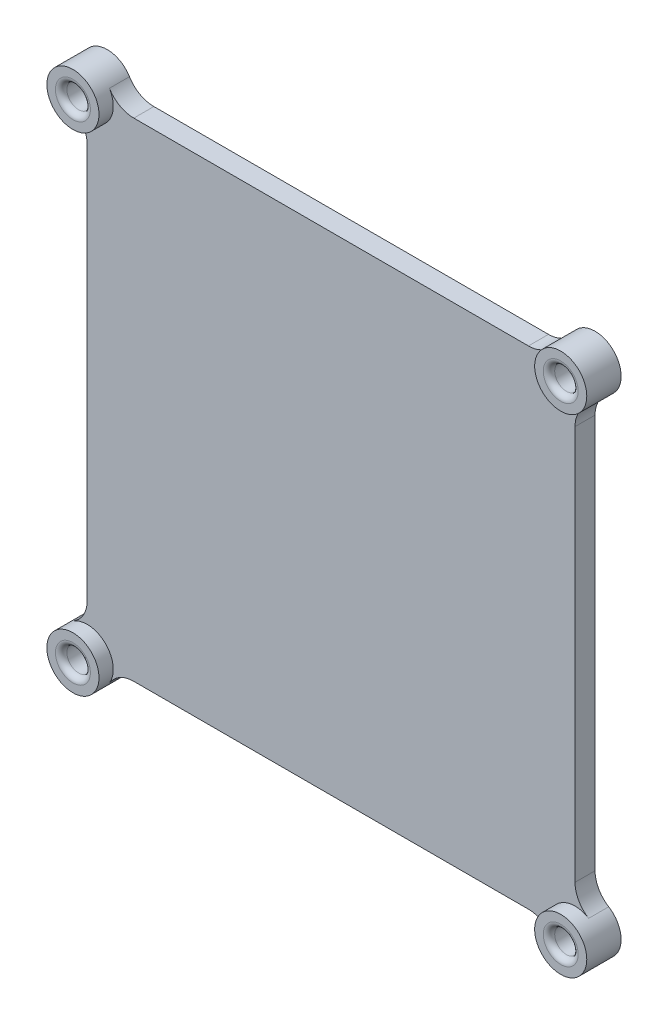
ISO-10303-21;
HEADER;
FILE_DESCRIPTION(('STEP AP214'),'2;1');
FILE_NAME('part.step','',(''),(''),'','','');
FILE_SCHEMA(('AUTOMOTIVE_DESIGN { 1 0 10303 214 1 1 1 1 }'));
ENDSEC;
DATA;
#1=APPLICATION_CONTEXT('core data for automotive mechanical design processes');
#2=APPLICATION_PROTOCOL_DEFINITION('international standard','automotive_design',2000,#1);
#3=PRODUCT_CONTEXT('',#1,'mechanical');
#4=PRODUCT('Part','Part','',(#3));
#5=PRODUCT_RELATED_PRODUCT_CATEGORY('part','',(#4));
#6=PRODUCT_DEFINITION_FORMATION('','',#4);
#7=PRODUCT_DEFINITION_CONTEXT('part definition',#1,'design');
#8=PRODUCT_DEFINITION('design','',#6,#7);
#9=PRODUCT_DEFINITION_SHAPE('','',#8);
#10=(LENGTH_UNIT() NAMED_UNIT(*) SI_UNIT(.MILLI.,.METRE.));
#11=(NAMED_UNIT(*) PLANE_ANGLE_UNIT() SI_UNIT($,.RADIAN.));
#12=(NAMED_UNIT(*) SI_UNIT($,.STERADIAN.) SOLID_ANGLE_UNIT());
#13=UNCERTAINTY_MEASURE_WITH_UNIT(LENGTH_MEASURE(1.E-05),#10,'distance_accuracy_value','');
#14=(GEOMETRIC_REPRESENTATION_CONTEXT(3) GLOBAL_UNCERTAINTY_ASSIGNED_CONTEXT((#13)) GLOBAL_UNIT_ASSIGNED_CONTEXT((#10,
#11,#12)) REPRESENTATION_CONTEXT('',''));
#15=CARTESIAN_POINT('',(0.,0.,0.));
#16=DIRECTION('',(0.,0.,1.));
#17=DIRECTION('',(1.,0.,0.));
#18=AXIS2_PLACEMENT_3D('',#15,#16,#17);
#19=CARTESIAN_POINT('',(0.,0.,3.5));
#20=DIRECTION('',(0.,0.,1.));
#21=DIRECTION('',(1.,0.,0.));
#22=AXIS2_PLACEMENT_3D('',#19,#20,#21);
#23=PLANE('',#22);
#24=CARTESIAN_POINT('',(-7.5,-74.5635081269628,3.5));
#25=DIRECTION('',(0.,0.,1.));
#26=DIRECTION('',(1.,0.,0.));
#27=AXIS2_PLACEMENT_3D('',#24,#25,#26);
#28=CIRCLE('',#27,5.);
#29=CARTESIAN_POINT('',(-2.5,-74.5635081269628,3.5));
#30=VERTEX_POINT('',#29);
#31=CARTESIAN_POINT('',(-4.88219895287958,-78.8234515159875,3.5));
#32=VERTEX_POINT('',#31);
#33=EDGE_CURVE('E181',#30,#32,#28,.F.);
#34=ORIENTED_EDGE('',*,*,#33,.T.);
#35=CARTESIAN_POINT('',(-2.49999999999941,-82.7,3.5));
#36=DIRECTION('',(0.,0.,1.));
#37=DIRECTION('',(1.,0.,0.));
#38=AXIS2_PLACEMENT_3D('',#35,#36,#37);
#39=CIRCLE('',#38,4.55);
#40=CARTESIAN_POINT('',(1.37654848401279,-85.0821989528796,3.5));
#41=VERTEX_POINT('',#40);
#42=EDGE_CURVE('E173',#41,#32,#39,.T.);
#43=ORIENTED_EDGE('',*,*,#42,.F.);
#44=CARTESIAN_POINT('',(5.63649187303717,-87.7,3.5));
#45=DIRECTION('',(0.,0.,1.));
#46=DIRECTION('',(1.,0.,0.));
#47=AXIS2_PLACEMENT_3D('',#44,#45,#46);
#48=CIRCLE('',#47,5.);
#49=CARTESIAN_POINT('',(5.63649187303717,-82.7,3.5));
#50=VERTEX_POINT('',#49);
#51=EDGE_CURVE('E156',#41,#50,#48,.F.);
#52=ORIENTED_EDGE('',*,*,#51,.T.);
#53=DIRECTION('',(1.,0.,0.));
#54=VECTOR('',#53,1.);
#55=CARTESIAN_POINT('',(0.,-82.7,3.5));
#56=LINE('',#55,#54);
#57=CARTESIAN_POINT('',(74.5635081269628,-82.7,3.5));
#58=VERTEX_POINT('',#57);
#59=EDGE_CURVE('E221',#50,#58,#56,.T.);
#60=ORIENTED_EDGE('',*,*,#59,.T.);
#61=CARTESIAN_POINT('',(74.5635081269628,-87.7,3.5));
#62=DIRECTION('',(0.,0.,1.));
#63=DIRECTION('',(1.,0.,0.));
#64=AXIS2_PLACEMENT_3D('',#61,#62,#63);
#65=CIRCLE('',#64,5.);
#66=CARTESIAN_POINT('',(78.8234515159875,-85.0821989528796,3.5));
#67=VERTEX_POINT('',#66);
#68=EDGE_CURVE('E286',#58,#67,#65,.F.);
#69=ORIENTED_EDGE('',*,*,#68,.T.);
#70=CARTESIAN_POINT('',(82.7000000000006,-82.7,3.5));
#71=DIRECTION('',(0.,0.,1.));
#72=DIRECTION('',(1.,0.,0.));
#73=AXIS2_PLACEMENT_3D('',#70,#71,#72);
#74=CIRCLE('',#73,4.55);
#75=CARTESIAN_POINT('',(85.0821989528799,-78.8234515159875,3.5));
#76=VERTEX_POINT('',#75);
#77=EDGE_CURVE('E187',#76,#67,#74,.T.);
#78=ORIENTED_EDGE('',*,*,#77,.F.);
#79=CARTESIAN_POINT('',(87.7,-74.5635081269628,3.5));
#80=DIRECTION('',(0.,0.,1.));
#81=DIRECTION('',(1.,0.,0.));
#82=AXIS2_PLACEMENT_3D('',#79,#80,#81);
#83=CIRCLE('',#82,5.);
#84=CARTESIAN_POINT('',(82.7,-74.5635081269628,3.5));
#85=VERTEX_POINT('',#84);
#86=EDGE_CURVE('E290',#76,#85,#83,.F.);
#87=ORIENTED_EDGE('',*,*,#86,.T.);
#88=DIRECTION('',(0.,-1.,0.));
#89=VECTOR('',#88,1.);
#90=CARTESIAN_POINT('',(82.7,0.,3.5));
#91=LINE('',#90,#89);
#92=CARTESIAN_POINT('',(82.7,-5.63649187303699,3.5));
#93=VERTEX_POINT('',#92);
#94=EDGE_CURVE('E224',#93,#85,#91,.T.);
#95=ORIENTED_EDGE('',*,*,#94,.F.);
#96=CARTESIAN_POINT('',(87.7,-5.63649187303699,3.5));
#97=DIRECTION('',(0.,0.,1.));
#98=DIRECTION('',(1.,0.,0.));
#99=AXIS2_PLACEMENT_3D('',#96,#97,#98);
#100=CIRCLE('',#99,5.);
#101=CARTESIAN_POINT('',(85.0821989528794,-1.37654848401239,3.5));
#102=VERTEX_POINT('',#101);
#103=EDGE_CURVE('E294',#93,#102,#100,.F.);
#104=ORIENTED_EDGE('',*,*,#103,.T.);
#105=CARTESIAN_POINT('',(82.6999999999997,2.5,3.5));
#106=DIRECTION('',(0.,0.,1.));
#107=DIRECTION('',(1.,0.,0.));
#108=AXIS2_PLACEMENT_3D('',#105,#106,#107);
#109=CIRCLE('',#108,4.55);
#110=CARTESIAN_POINT('',(78.8234515159872,4.88219895287958,3.5));
#111=VERTEX_POINT('',#110);
#112=EDGE_CURVE('E195',#111,#102,#109,.T.);
#113=ORIENTED_EDGE('',*,*,#112,.F.);
#114=CARTESIAN_POINT('',(74.5635081269625,7.5,3.5));
#115=DIRECTION('',(0.,0.,1.));
#116=DIRECTION('',(1.,0.,0.));
#117=AXIS2_PLACEMENT_3D('',#114,#115,#116);
#118=CIRCLE('',#117,5.);
#119=CARTESIAN_POINT('',(74.5635081269625,2.5,3.5));
#120=VERTEX_POINT('',#119);
#121=EDGE_CURVE('E298',#111,#120,#118,.F.);
#122=ORIENTED_EDGE('',*,*,#121,.T.);
#123=DIRECTION('',(1.,0.,0.));
#124=VECTOR('',#123,1.);
#125=CARTESIAN_POINT('',(0.,2.5,3.5));
#126=LINE('',#125,#124);
#127=CARTESIAN_POINT('',(5.63649187303688,2.5,3.5));
#128=VERTEX_POINT('',#127);
#129=EDGE_CURVE('E177',#128,#120,#126,.T.);
#130=ORIENTED_EDGE('',*,*,#129,.F.);
#131=CARTESIAN_POINT('',(5.63649187303688,7.5,3.5));
#132=DIRECTION('',(0.,0.,1.));
#133=DIRECTION('',(1.,0.,0.));
#134=AXIS2_PLACEMENT_3D('',#131,#132,#133);
#135=CIRCLE('',#134,5.);
#136=CARTESIAN_POINT('',(1.37654848401218,4.88219895287958,3.5));
#137=VERTEX_POINT('',#136);
#138=EDGE_CURVE('E302',#128,#137,#135,.F.);
#139=ORIENTED_EDGE('',*,*,#138,.T.);
#140=CARTESIAN_POINT('',(-2.50000000000029,2.5,3.5));
#141=DIRECTION('',(0.,0.,1.));
#142=DIRECTION('',(1.,0.,0.));
#143=AXIS2_PLACEMENT_3D('',#140,#141,#142);
#144=CIRCLE('',#143,4.55);
#145=CARTESIAN_POINT('',(-4.88219895287973,-1.37654848401256,3.5));
#146=VERTEX_POINT('',#145);
#147=EDGE_CURVE('E56',#146,#137,#144,.T.);
#148=ORIENTED_EDGE('',*,*,#147,.F.);
#149=CARTESIAN_POINT('',(-7.5,-5.63649187303735,3.5));
#150=DIRECTION('',(0.,0.,1.));
#151=DIRECTION('',(1.,0.,0.));
#152=AXIS2_PLACEMENT_3D('',#149,#150,#151);
#153=CIRCLE('',#152,5.);
#154=CARTESIAN_POINT('',(-2.5,-5.63649187303735,3.5));
#155=VERTEX_POINT('',#154);
#156=EDGE_CURVE('E206',#146,#155,#153,.F.);
#157=ORIENTED_EDGE('',*,*,#156,.T.);
#158=DIRECTION('',(0.,-1.,0.));
#159=VECTOR('',#158,1.);
#160=CARTESIAN_POINT('',(-2.5,0.,3.5));
#161=LINE('',#160,#159);
#162=EDGE_CURVE('E219',#155,#30,#161,.T.);
#163=ORIENTED_EDGE('',*,*,#162,.T.);
#164=EDGE_LOOP('',(#34,#43,#52,#60,#69,#78,#87,#95,#104,#113,#122,#130,#139,#148,#157,#163));
#165=FACE_BOUND('',#164,.T.);
#166=ADVANCED_FACE('F41',(#165),#23,.T.);
#167=CARTESIAN_POINT('',(-2.50000000000029,2.5,3.5));
#168=DIRECTION('',(0.,0.,-1.));
#169=DIRECTION('',(-1.,0.,0.));
#170=AXIS2_PLACEMENT_3D('',#167,#168,#169);
#171=CYLINDRICAL_SURFACE('',#170,4.55);
#172=DIRECTION('',(0.,0.,-1.));
#173=VECTOR('',#172,1.);
#174=CARTESIAN_POINT('',(-4.88219895287973,-1.37654848401256,3.5));
#175=LINE('',#174,#173);
#176=CARTESIAN_POINT('',(-4.88219895287973,-1.37654848401256,0.));
#177=VERTEX_POINT('',#176);
#178=EDGE_CURVE('E277',#177,#146,#175,.F.);
#179=ORIENTED_EDGE('',*,*,#178,.T.);
#180=ORIENTED_EDGE('',*,*,#147,.T.);
#181=DIRECTION('',(0.,0.,-1.));
#182=VECTOR('',#181,1.);
#183=CARTESIAN_POINT('',(1.37654848401218,4.88219895287958,3.5));
#184=LINE('',#183,#182);
#185=CARTESIAN_POINT('',(1.37654848401218,4.88219895287958,0.));
#186=VERTEX_POINT('',#185);
#187=EDGE_CURVE('E279',#137,#186,#184,.T.);
#188=ORIENTED_EDGE('',*,*,#187,.T.);
#189=CARTESIAN_POINT('',(-2.50000000000029,2.5,0.));
#190=DIRECTION('',(0.,0.,1.));
#191=DIRECTION('',(1.,0.,0.));
#192=AXIS2_PLACEMENT_3D('',#189,#190,#191);
#193=CIRCLE('',#192,4.55);
#194=EDGE_CURVE('E218',#186,#177,#193,.T.);
#195=ORIENTED_EDGE('',*,*,#194,.T.);
#196=EDGE_LOOP('',(#179,#180,#188,#195));
#197=FACE_BOUND('',#196,.T.);
#198=CARTESIAN_POINT('',(-2.50000000000029,2.5,6.));
#199=DIRECTION('',(0.,0.,1.));
#200=DIRECTION('',(1.,0.,0.));
#201=AXIS2_PLACEMENT_3D('',#198,#199,#200);
#202=CIRCLE('',#201,4.55);
#203=CARTESIAN_POINT('',(2.04999999999971,2.5,6.));
#204=VERTEX_POINT('',#203);
#205=EDGE_CURVE('E198',#204,#204,#202,.T.);
#206=ORIENTED_EDGE('',*,*,#205,.F.);
#207=EDGE_LOOP('',(#206));
#208=FACE_BOUND('',#207,.T.);
#209=ADVANCED_FACE('F338',(#197,#208),#171,.T.);
#210=CARTESIAN_POINT('',(-2.5,0.,3.5));
#211=DIRECTION('',(1.,0.,0.));
#212=DIRECTION('',(0.,0.,-1.));
#213=AXIS2_PLACEMENT_3D('',#210,#211,#212);
#214=PLANE('',#213);
#215=DIRECTION('',(0.,-1.,0.));
#216=VECTOR('',#215,1.);
#217=CARTESIAN_POINT('',(-2.5,0.,0.));
#218=LINE('',#217,#216);
#219=CARTESIAN_POINT('',(-2.5,-5.63649187303735,0.));
#220=VERTEX_POINT('',#219);
#221=CARTESIAN_POINT('',(-2.5,-74.5635081269628,0.));
#222=VERTEX_POINT('',#221);
#223=EDGE_CURVE('E230',#220,#222,#218,.T.);
#224=ORIENTED_EDGE('',*,*,#223,.T.);
#225=DIRECTION('',(0.,0.,1.));
#226=VECTOR('',#225,1.);
#227=CARTESIAN_POINT('',(-2.5,-74.5635081269628,3.5));
#228=LINE('',#227,#226);
#229=EDGE_CURVE('E252',#222,#30,#228,.T.);
#230=ORIENTED_EDGE('',*,*,#229,.T.);
#231=ORIENTED_EDGE('',*,*,#162,.F.);
#232=DIRECTION('',(0.,0.,1.));
#233=VECTOR('',#232,1.);
#234=CARTESIAN_POINT('',(-2.5,-5.63649187303735,0.));
#235=LINE('',#234,#233);
#236=EDGE_CURVE('E249',#155,#220,#235,.F.);
#237=ORIENTED_EDGE('',*,*,#236,.T.);
#238=EDGE_LOOP('',(#224,#230,#231,#237));
#239=FACE_BOUND('',#238,.T.);
#240=ADVANCED_FACE('F343',(#239),#214,.F.);
#241=CARTESIAN_POINT('',(-2.5,-82.7,3.5));
#242=DIRECTION('',(0.,0.,-1.));
#243=DIRECTION('',(-1.,0.,0.));
#244=AXIS2_PLACEMENT_3D('',#241,#242,#243);
#245=CYLINDRICAL_SURFACE('',#244,4.55);
#246=DIRECTION('',(0.,0.,-1.));
#247=VECTOR('',#246,1.);
#248=CARTESIAN_POINT('',(1.37654848401247,-85.0821989528796,3.5));
#249=LINE('',#248,#247);
#250=CARTESIAN_POINT('',(1.37654848401248,-85.0821989528796,0.));
#251=VERTEX_POINT('',#250);
#252=EDGE_CURVE('E159',#251,#41,#249,.F.);
#253=ORIENTED_EDGE('',*,*,#252,.T.);
#254=ORIENTED_EDGE('',*,*,#42,.T.);
#255=DIRECTION('',(0.,0.,-1.));
#256=VECTOR('',#255,1.);
#257=CARTESIAN_POINT('',(-4.88219895287958,-78.8234515159875,3.5));
#258=LINE('',#257,#256);
#259=CARTESIAN_POINT('',(-4.88219895287958,-78.8234515159875,0.));
#260=VERTEX_POINT('',#259);
#261=EDGE_CURVE('E176',#32,#260,#258,.T.);
#262=ORIENTED_EDGE('',*,*,#261,.T.);
#263=CARTESIAN_POINT('',(-2.5,-82.7,0.));
#264=DIRECTION('',(0.,0.,1.));
#265=DIRECTION('',(1.,0.,0.));
#266=AXIS2_PLACEMENT_3D('',#263,#264,#265);
#267=CIRCLE('',#266,4.55);
#268=EDGE_CURVE('E175',#260,#251,#267,.T.);
#269=ORIENTED_EDGE('',*,*,#268,.T.);
#270=EDGE_LOOP('',(#253,#254,#262,#269));
#271=FACE_BOUND('',#270,.T.);
#272=CARTESIAN_POINT('',(-2.49999999999941,-82.7,6.));
#273=DIRECTION('',(0.,0.,1.));
#274=DIRECTION('',(1.,0.,0.));
#275=AXIS2_PLACEMENT_3D('',#272,#273,#274);
#276=CIRCLE('',#275,4.55);
#277=CARTESIAN_POINT('',(2.05000000000059,-82.7,6.));
#278=VERTEX_POINT('',#277);
#279=EDGE_CURVE('E184',#278,#278,#276,.T.);
#280=ORIENTED_EDGE('',*,*,#279,.F.);
#281=EDGE_LOOP('',(#280));
#282=FACE_BOUND('',#281,.T.);
#283=ADVANCED_FACE('F171',(#271,#282),#245,.T.);
#284=CARTESIAN_POINT('',(0.,-82.7,3.5));
#285=DIRECTION('',(0.,1.,0.));
#286=DIRECTION('',(0.,0.,1.));
#287=AXIS2_PLACEMENT_3D('',#284,#285,#286);
#288=PLANE('',#287);
#289=ORIENTED_EDGE('',*,*,#59,.F.);
#290=DIRECTION('',(0.,0.,1.));
#291=VECTOR('',#290,1.);
#292=CARTESIAN_POINT('',(5.63649187303717,-82.7,0.));
#293=LINE('',#292,#291);
#294=CARTESIAN_POINT('',(5.63649187303717,-82.7,0.));
#295=VERTEX_POINT('',#294);
#296=EDGE_CURVE('E161',#50,#295,#293,.F.);
#297=ORIENTED_EDGE('',*,*,#296,.T.);
#298=DIRECTION('',(1.,0.,0.));
#299=VECTOR('',#298,1.);
#300=CARTESIAN_POINT('',(0.,-82.7,0.));
#301=LINE('',#300,#299);
#302=CARTESIAN_POINT('',(74.5635081269628,-82.7,0.));
#303=VERTEX_POINT('',#302);
#304=EDGE_CURVE('E234',#295,#303,#301,.T.);
#305=ORIENTED_EDGE('',*,*,#304,.T.);
#306=DIRECTION('',(0.,0.,1.));
#307=VECTOR('',#306,1.);
#308=CARTESIAN_POINT('',(74.5635081269628,-82.7,3.5));
#309=LINE('',#308,#307);
#310=EDGE_CURVE('E254',#303,#58,#309,.T.);
#311=ORIENTED_EDGE('',*,*,#310,.T.);
#312=EDGE_LOOP('',(#289,#297,#305,#311));
#313=FACE_BOUND('',#312,.T.);
#314=ADVANCED_FACE('F385',(#313),#288,.F.);
#315=CARTESIAN_POINT('',(82.7,-82.7,3.5));
#316=DIRECTION('',(0.,0.,-1.));
#317=DIRECTION('',(-1.,0.,0.));
#318=AXIS2_PLACEMENT_3D('',#315,#316,#317);
#319=CYLINDRICAL_SURFACE('',#318,4.55);
#320=DIRECTION('',(0.,0.,-1.));
#321=VECTOR('',#320,1.);
#322=CARTESIAN_POINT('',(85.0821989528796,-78.8234515159875,3.5));
#323=LINE('',#322,#321);
#324=CARTESIAN_POINT('',(85.0821989528796,-78.8234515159875,0.));
#325=VERTEX_POINT('',#324);
#326=EDGE_CURVE('E257',#325,#76,#323,.F.);
#327=ORIENTED_EDGE('',*,*,#326,.T.);
#328=ORIENTED_EDGE('',*,*,#77,.T.);
#329=DIRECTION('',(0.,0.,-1.));
#330=VECTOR('',#329,1.);
#331=CARTESIAN_POINT('',(78.8234515159875,-85.0821989528796,3.5));
#332=LINE('',#331,#330);
#333=CARTESIAN_POINT('',(78.8234515159875,-85.0821989528796,0.));
#334=VERTEX_POINT('',#333);
#335=EDGE_CURVE('E260',#67,#334,#332,.T.);
#336=ORIENTED_EDGE('',*,*,#335,.T.);
#337=CARTESIAN_POINT('',(82.7,-82.7,0.));
#338=DIRECTION('',(0.,0.,1.));
#339=DIRECTION('',(1.,0.,0.));
#340=AXIS2_PLACEMENT_3D('',#337,#338,#339);
#341=CIRCLE('',#340,4.55);
#342=EDGE_CURVE('E237',#334,#325,#341,.T.);
#343=ORIENTED_EDGE('',*,*,#342,.T.);
#344=EDGE_LOOP('',(#327,#328,#336,#343));
#345=FACE_BOUND('',#344,.T.);
#346=CARTESIAN_POINT('',(82.7000000000006,-82.7,6.));
#347=DIRECTION('',(0.,0.,1.));
#348=DIRECTION('',(1.,0.,0.));
#349=AXIS2_PLACEMENT_3D('',#346,#347,#348);
#350=CIRCLE('',#349,4.55);
#351=CARTESIAN_POINT('',(87.2500000000006,-82.7,6.));
#352=VERTEX_POINT('',#351);
#353=EDGE_CURVE('E183',#352,#352,#350,.T.);
#354=ORIENTED_EDGE('',*,*,#353,.F.);
#355=EDGE_LOOP('',(#354));
#356=FACE_BOUND('',#355,.T.);
#357=ADVANCED_FACE('F381',(#345,#356),#319,.T.);
#358=CARTESIAN_POINT('',(82.7,0.,3.5));
#359=DIRECTION('',(1.,0.,0.));
#360=DIRECTION('',(0.,0.,-1.));
#361=AXIS2_PLACEMENT_3D('',#358,#359,#360);
#362=PLANE('',#361);
#363=ORIENTED_EDGE('',*,*,#94,.T.);
#364=DIRECTION('',(0.,0.,-1.));
#365=VECTOR('',#364,1.);
#366=CARTESIAN_POINT('',(82.7,-74.5635081269628,3.5));
#367=LINE('',#366,#365);
#368=CARTESIAN_POINT('',(82.7,-74.5635081269628,0.));
#369=VERTEX_POINT('',#368);
#370=EDGE_CURVE('E264',#85,#369,#367,.T.);
#371=ORIENTED_EDGE('',*,*,#370,.T.);
#372=DIRECTION('',(0.,-1.,0.));
#373=VECTOR('',#372,1.);
#374=CARTESIAN_POINT('',(82.7,0.,0.));
#375=LINE('',#374,#373);
#376=CARTESIAN_POINT('',(82.7,-5.63649187303699,0.));
#377=VERTEX_POINT('',#376);
#378=EDGE_CURVE('E240',#377,#369,#375,.T.);
#379=ORIENTED_EDGE('',*,*,#378,.F.);
#380=DIRECTION('',(0.,0.,-1.));
#381=VECTOR('',#380,1.);
#382=CARTESIAN_POINT('',(82.7,-5.63649187303699,3.5));
#383=LINE('',#382,#381);
#384=EDGE_CURVE('E262',#377,#93,#383,.F.);
#385=ORIENTED_EDGE('',*,*,#384,.T.);
#386=EDGE_LOOP('',(#363,#371,#379,#385));
#387=FACE_BOUND('',#386,.T.);
#388=ADVANCED_FACE('F377',(#387),#362,.T.);
#389=CARTESIAN_POINT('',(82.6999999999997,2.5,3.5));
#390=DIRECTION('',(0.,0.,-1.));
#391=DIRECTION('',(-1.,0.,0.));
#392=AXIS2_PLACEMENT_3D('',#389,#390,#391);
#393=CYLINDRICAL_SURFACE('',#392,4.55);
#394=DIRECTION('',(0.,0.,-1.));
#395=VECTOR('',#394,1.);
#396=CARTESIAN_POINT('',(78.8234515159872,4.88219895287958,3.5));
#397=LINE('',#396,#395);
#398=CARTESIAN_POINT('',(78.8234515159872,4.88219895287958,0.));
#399=VERTEX_POINT('',#398);
#400=EDGE_CURVE('E267',#399,#111,#397,.F.);
#401=ORIENTED_EDGE('',*,*,#400,.T.);
#402=ORIENTED_EDGE('',*,*,#112,.T.);
#403=DIRECTION('',(0.,0.,-1.));
#404=VECTOR('',#403,1.);
#405=CARTESIAN_POINT('',(85.0821989528794,-1.37654848401239,3.5));
#406=LINE('',#405,#404);
#407=CARTESIAN_POINT('',(85.0821989528794,-1.37654848401239,0.));
#408=VERTEX_POINT('',#407);
#409=EDGE_CURVE('E270',#102,#408,#406,.T.);
#410=ORIENTED_EDGE('',*,*,#409,.T.);
#411=CARTESIAN_POINT('',(82.6999999999997,2.5,0.));
#412=DIRECTION('',(0.,0.,1.));
#413=DIRECTION('',(1.,0.,0.));
#414=AXIS2_PLACEMENT_3D('',#411,#412,#413);
#415=CIRCLE('',#414,4.55);
#416=EDGE_CURVE('E243',#408,#399,#415,.T.);
#417=ORIENTED_EDGE('',*,*,#416,.T.);
#418=EDGE_LOOP('',(#401,#402,#410,#417));
#419=FACE_BOUND('',#418,.T.);
#420=CARTESIAN_POINT('',(82.6999999999997,2.5,6.));
#421=DIRECTION('',(0.,0.,1.));
#422=DIRECTION('',(1.,0.,0.));
#423=AXIS2_PLACEMENT_3D('',#420,#421,#422);
#424=CIRCLE('',#423,4.55);
#425=CARTESIAN_POINT('',(87.2499999999997,2.5,6.));
#426=VERTEX_POINT('',#425);
#427=EDGE_CURVE('E193',#426,#426,#424,.T.);
#428=ORIENTED_EDGE('',*,*,#427,.F.);
#429=EDGE_LOOP('',(#428));
#430=FACE_BOUND('',#429,.T.);
#431=ADVANCED_FACE('F373',(#419,#430),#393,.T.);
#432=CARTESIAN_POINT('',(0.,2.5,3.5));
#433=DIRECTION('',(0.,1.,0.));
#434=DIRECTION('',(0.,0.,1.));
#435=AXIS2_PLACEMENT_3D('',#432,#433,#434);
#436=PLANE('',#435);
#437=ORIENTED_EDGE('',*,*,#129,.T.);
#438=DIRECTION('',(0.,0.,-1.));
#439=VECTOR('',#438,1.);
#440=CARTESIAN_POINT('',(74.5635081269625,2.5,3.5));
#441=LINE('',#440,#439);
#442=CARTESIAN_POINT('',(74.5635081269625,2.5,0.));
#443=VERTEX_POINT('',#442);
#444=EDGE_CURVE('E274',#120,#443,#441,.T.);
#445=ORIENTED_EDGE('',*,*,#444,.T.);
#446=DIRECTION('',(1.,0.,0.));
#447=VECTOR('',#446,1.);
#448=CARTESIAN_POINT('',(0.,2.5,0.));
#449=LINE('',#448,#447);
#450=CARTESIAN_POINT('',(5.63649187303688,2.5,0.));
#451=VERTEX_POINT('',#450);
#452=EDGE_CURVE('E222',#451,#443,#449,.T.);
#453=ORIENTED_EDGE('',*,*,#452,.F.);
#454=DIRECTION('',(0.,0.,-1.));
#455=VECTOR('',#454,1.);
#456=CARTESIAN_POINT('',(5.63649187303688,2.5,3.5));
#457=LINE('',#456,#455);
#458=EDGE_CURVE('E272',#451,#128,#457,.F.);
#459=ORIENTED_EDGE('',*,*,#458,.T.);
#460=EDGE_LOOP('',(#437,#445,#453,#459));
#461=FACE_BOUND('',#460,.T.);
#462=ADVANCED_FACE('F354',(#461),#436,.T.);
#463=CARTESIAN_POINT('',(0.,0.,0.));
#464=DIRECTION('',(0.,0.,1.));
#465=DIRECTION('',(1.,0.,0.));
#466=AXIS2_PLACEMENT_3D('',#463,#464,#465);
#467=PLANE('',#466);
#468=CARTESIAN_POINT('',(87.7,-74.5635081269628,0.));
#469=DIRECTION('',(0.,0.,1.));
#470=DIRECTION('',(1.,0.,0.));
#471=AXIS2_PLACEMENT_3D('',#468,#469,#470);
#472=CIRCLE('',#471,5.);
#473=EDGE_CURVE('E288',#369,#325,#472,.T.);
#474=ORIENTED_EDGE('',*,*,#473,.T.);
#475=ORIENTED_EDGE('',*,*,#342,.F.);
#476=CARTESIAN_POINT('',(74.5635081269628,-87.7,0.));
#477=DIRECTION('',(0.,0.,1.));
#478=DIRECTION('',(1.,0.,0.));
#479=AXIS2_PLACEMENT_3D('',#476,#477,#478);
#480=CIRCLE('',#479,5.);
#481=EDGE_CURVE('E165',#334,#303,#480,.T.);
#482=ORIENTED_EDGE('',*,*,#481,.T.);
#483=ORIENTED_EDGE('',*,*,#304,.F.);
#484=CARTESIAN_POINT('',(5.63649187303717,-87.7,0.));
#485=DIRECTION('',(0.,0.,1.));
#486=DIRECTION('',(1.,0.,0.));
#487=AXIS2_PLACEMENT_3D('',#484,#485,#486);
#488=CIRCLE('',#487,5.);
#489=EDGE_CURVE('E166',#295,#251,#488,.T.);
#490=ORIENTED_EDGE('',*,*,#489,.T.);
#491=ORIENTED_EDGE('',*,*,#268,.F.);
#492=CARTESIAN_POINT('',(-7.5,-74.5635081269628,0.));
#493=DIRECTION('',(0.,0.,1.));
#494=DIRECTION('',(1.,0.,0.));
#495=AXIS2_PLACEMENT_3D('',#492,#493,#494);
#496=CIRCLE('',#495,5.);
#497=EDGE_CURVE('E281',#260,#222,#496,.T.);
#498=ORIENTED_EDGE('',*,*,#497,.T.);
#499=ORIENTED_EDGE('',*,*,#223,.F.);
#500=CARTESIAN_POINT('',(-7.5,-5.63649187303735,0.));
#501=DIRECTION('',(0.,0.,1.));
#502=DIRECTION('',(1.,0.,0.));
#503=AXIS2_PLACEMENT_3D('',#500,#501,#502);
#504=CIRCLE('',#503,5.);
#505=EDGE_CURVE('E64',#220,#177,#504,.T.);
#506=ORIENTED_EDGE('',*,*,#505,.T.);
#507=ORIENTED_EDGE('',*,*,#194,.F.);
#508=CARTESIAN_POINT('',(5.63649187303688,7.5,0.));
#509=DIRECTION('',(0.,0.,1.));
#510=DIRECTION('',(1.,0.,0.));
#511=AXIS2_PLACEMENT_3D('',#508,#509,#510);
#512=CIRCLE('',#511,5.);
#513=EDGE_CURVE('E300',#186,#451,#512,.T.);
#514=ORIENTED_EDGE('',*,*,#513,.T.);
#515=ORIENTED_EDGE('',*,*,#452,.T.);
#516=CARTESIAN_POINT('',(74.5635081269625,7.5,0.));
#517=DIRECTION('',(0.,0.,1.));
#518=DIRECTION('',(1.,0.,0.));
#519=AXIS2_PLACEMENT_3D('',#516,#517,#518);
#520=CIRCLE('',#519,5.);
#521=EDGE_CURVE('E296',#443,#399,#520,.T.);
#522=ORIENTED_EDGE('',*,*,#521,.T.);
#523=ORIENTED_EDGE('',*,*,#416,.F.);
#524=CARTESIAN_POINT('',(87.7,-5.63649187303699,0.));
#525=DIRECTION('',(0.,0.,1.));
#526=DIRECTION('',(1.,0.,0.));
#527=AXIS2_PLACEMENT_3D('',#524,#525,#526);
#528=CIRCLE('',#527,5.);
#529=EDGE_CURVE('E292',#408,#377,#528,.T.);
#530=ORIENTED_EDGE('',*,*,#529,.T.);
#531=ORIENTED_EDGE('',*,*,#378,.T.);
#532=EDGE_LOOP('',(#474,#475,#482,#483,#490,#491,#498,#499,#506,#507,#514,#515,#522,#523,#530,#531));
#533=FACE_BOUND('',#532,.T.);
#534=ADVANCED_FACE('F350',(#533),#467,.F.);
#535=CARTESIAN_POINT('',(-7.5,-74.5635081269628,3.5));
#536=DIRECTION('',(0.,0.,-1.));
#537=DIRECTION('',(-1.,0.,0.));
#538=AXIS2_PLACEMENT_3D('',#535,#536,#537);
#539=CYLINDRICAL_SURFACE('',#538,5.);
#540=ORIENTED_EDGE('',*,*,#33,.F.);
#541=ORIENTED_EDGE('',*,*,#229,.F.);
#542=ORIENTED_EDGE('',*,*,#497,.F.);
#543=ORIENTED_EDGE('',*,*,#261,.F.);
#544=EDGE_LOOP('',(#540,#541,#542,#543));
#545=FACE_BOUND('',#544,.T.);
#546=ADVANCED_FACE('F353',(#545),#539,.F.);
#547=CARTESIAN_POINT('',(5.63649187303717,-87.7,3.5));
#548=DIRECTION('',(0.,0.,-1.));
#549=DIRECTION('',(-1.,0.,0.));
#550=AXIS2_PLACEMENT_3D('',#547,#548,#549);
#551=CYLINDRICAL_SURFACE('',#550,5.);
#552=ORIENTED_EDGE('',*,*,#51,.F.);
#553=ORIENTED_EDGE('',*,*,#252,.F.);
#554=ORIENTED_EDGE('',*,*,#489,.F.);
#555=ORIENTED_EDGE('',*,*,#296,.F.);
#556=EDGE_LOOP('',(#552,#553,#554,#555));
#557=FACE_BOUND('',#556,.T.);
#558=ADVANCED_FACE('F158',(#557),#551,.F.);
#559=CARTESIAN_POINT('',(74.5635081269628,-87.7,3.5));
#560=DIRECTION('',(0.,0.,-1.));
#561=DIRECTION('',(-1.,0.,0.));
#562=AXIS2_PLACEMENT_3D('',#559,#560,#561);
#563=CYLINDRICAL_SURFACE('',#562,5.);
#564=ORIENTED_EDGE('',*,*,#68,.F.);
#565=ORIENTED_EDGE('',*,*,#310,.F.);
#566=ORIENTED_EDGE('',*,*,#481,.F.);
#567=ORIENTED_EDGE('',*,*,#335,.F.);
#568=EDGE_LOOP('',(#564,#565,#566,#567));
#569=FACE_BOUND('',#568,.T.);
#570=ADVANCED_FACE('F405',(#569),#563,.F.);
#571=CARTESIAN_POINT('',(87.7,-74.5635081269628,3.5));
#572=DIRECTION('',(0.,0.,-1.));
#573=DIRECTION('',(-1.,0.,0.));
#574=AXIS2_PLACEMENT_3D('',#571,#572,#573);
#575=CYLINDRICAL_SURFACE('',#574,5.);
#576=ORIENTED_EDGE('',*,*,#86,.F.);
#577=ORIENTED_EDGE('',*,*,#326,.F.);
#578=ORIENTED_EDGE('',*,*,#473,.F.);
#579=ORIENTED_EDGE('',*,*,#370,.F.);
#580=EDGE_LOOP('',(#576,#577,#578,#579));
#581=FACE_BOUND('',#580,.T.);
#582=ADVANCED_FACE('F408',(#581),#575,.F.);
#583=CARTESIAN_POINT('',(87.7,-5.63649187303699,3.5));
#584=DIRECTION('',(0.,0.,-1.));
#585=DIRECTION('',(-1.,0.,0.));
#586=AXIS2_PLACEMENT_3D('',#583,#584,#585);
#587=CYLINDRICAL_SURFACE('',#586,5.);
#588=ORIENTED_EDGE('',*,*,#103,.F.);
#589=ORIENTED_EDGE('',*,*,#384,.F.);
#590=ORIENTED_EDGE('',*,*,#529,.F.);
#591=ORIENTED_EDGE('',*,*,#409,.F.);
#592=EDGE_LOOP('',(#588,#589,#590,#591));
#593=FACE_BOUND('',#592,.T.);
#594=ADVANCED_FACE('F412',(#593),#587,.F.);
#595=CARTESIAN_POINT('',(74.5635081269625,7.5,3.5));
#596=DIRECTION('',(0.,0.,-1.));
#597=DIRECTION('',(-1.,0.,0.));
#598=AXIS2_PLACEMENT_3D('',#595,#596,#597);
#599=CYLINDRICAL_SURFACE('',#598,5.);
#600=ORIENTED_EDGE('',*,*,#121,.F.);
#601=ORIENTED_EDGE('',*,*,#400,.F.);
#602=ORIENTED_EDGE('',*,*,#521,.F.);
#603=ORIENTED_EDGE('',*,*,#444,.F.);
#604=EDGE_LOOP('',(#600,#601,#602,#603));
#605=FACE_BOUND('',#604,.T.);
#606=ADVANCED_FACE('F416',(#605),#599,.F.);
#607=CARTESIAN_POINT('',(5.63649187303688,7.5,3.5));
#608=DIRECTION('',(0.,0.,-1.));
#609=DIRECTION('',(-1.,0.,0.));
#610=AXIS2_PLACEMENT_3D('',#607,#608,#609);
#611=CYLINDRICAL_SURFACE('',#610,5.);
#612=ORIENTED_EDGE('',*,*,#138,.F.);
#613=ORIENTED_EDGE('',*,*,#458,.F.);
#614=ORIENTED_EDGE('',*,*,#513,.F.);
#615=ORIENTED_EDGE('',*,*,#187,.F.);
#616=EDGE_LOOP('',(#612,#613,#614,#615));
#617=FACE_BOUND('',#616,.T.);
#618=ADVANCED_FACE('F420',(#617),#611,.F.);
#619=CARTESIAN_POINT('',(-7.5,-5.63649187303735,3.5));
#620=DIRECTION('',(0.,0.,-1.));
#621=DIRECTION('',(-1.,0.,0.));
#622=AXIS2_PLACEMENT_3D('',#619,#620,#621);
#623=CYLINDRICAL_SURFACE('',#622,5.);
#624=ORIENTED_EDGE('',*,*,#156,.F.);
#625=ORIENTED_EDGE('',*,*,#178,.F.);
#626=ORIENTED_EDGE('',*,*,#505,.F.);
#627=ORIENTED_EDGE('',*,*,#236,.F.);
#628=EDGE_LOOP('',(#624,#625,#626,#627));
#629=FACE_BOUND('',#628,.T.);
#630=ADVANCED_FACE('F424',(#629),#623,.F.);
#631=CARTESIAN_POINT('',(-2.50000000000029,2.5,6.));
#632=DIRECTION('',(0.,0.,1.));
#633=DIRECTION('',(1.,0.,0.));
#634=AXIS2_PLACEMENT_3D('',#631,#632,#633);
#635=PLANE('',#634);
#636=CARTESIAN_POINT('',(-2.50000000000029,2.5,6.));
#637=DIRECTION('',(0.,0.,1.));
#638=DIRECTION('',(1.,0.,0.));
#639=AXIS2_PLACEMENT_3D('',#636,#637,#638);
#640=CIRCLE('',#639,3.05);
#641=CARTESIAN_POINT('',(0.549999999999707,2.5,6.));
#642=VERTEX_POINT('',#641);
#643=EDGE_CURVE('E11',#642,#642,#640,.F.);
#644=ORIENTED_EDGE('',*,*,#643,.T.);
#645=EDGE_LOOP('',(#644));
#646=FACE_BOUND('',#645,.T.);
#647=ORIENTED_EDGE('',*,*,#205,.T.);
#648=EDGE_LOOP('',(#647));
#649=FACE_BOUND('',#648,.T.);
#650=ADVANCED_FACE('F428',(#646,#649),#635,.T.);
#651=CARTESIAN_POINT('',(-2.50000000000029,2.5,1.));
#652=DIRECTION('',(0.,0.,-1.));
#653=DIRECTION('',(-1.,0.,0.));
#654=AXIS2_PLACEMENT_3D('',#651,#652,#653);
#655=PLANE('',#654);
#656=CARTESIAN_POINT('',(-2.50000000000029,2.5,1.));
#657=DIRECTION('',(0.,0.,-1.));
#658=DIRECTION('',(-1.,0.,0.));
#659=AXIS2_PLACEMENT_3D('',#656,#657,#658);
#660=CIRCLE('',#659,2.05);
#661=CARTESIAN_POINT('',(-4.55000000000029,2.5,1.));
#662=VERTEX_POINT('',#661);
#663=EDGE_CURVE('E212',#662,#662,#660,.T.);
#664=ORIENTED_EDGE('',*,*,#663,.F.);
#665=EDGE_LOOP('',(#664));
#666=FACE_BOUND('',#665,.T.);
#667=ADVANCED_FACE('F370',(#666),#655,.F.);
#668=CARTESIAN_POINT('',(-2.50000000000029,2.5,3.5));
#669=DIRECTION('',(0.,0.,-1.));
#670=DIRECTION('',(-1.,0.,0.));
#671=AXIS2_PLACEMENT_3D('',#668,#669,#670);
#672=CYLINDRICAL_SURFACE('',#671,2.05);
#673=CARTESIAN_POINT('',(-2.50000000000029,2.5,5.));
#674=DIRECTION('',(0.,0.,1.));
#675=DIRECTION('',(1.,0.,0.));
#676=AXIS2_PLACEMENT_3D('',#673,#674,#675);
#677=CIRCLE('',#676,2.05);
#678=CARTESIAN_POINT('',(-0.450000000000293,2.5,5.));
#679=VERTEX_POINT('',#678);
#680=EDGE_CURVE('E49',#679,#679,#677,.T.);
#681=ORIENTED_EDGE('',*,*,#680,.T.);
#682=EDGE_LOOP('',(#681));
#683=FACE_BOUND('',#682,.T.);
#684=ORIENTED_EDGE('',*,*,#663,.T.);
#685=EDGE_LOOP('',(#684));
#686=FACE_BOUND('',#685,.T.);
#687=ADVANCED_FACE('F325',(#683,#686),#672,.F.);
#688=CARTESIAN_POINT('',(82.6999999999997,2.5,6.));
#689=DIRECTION('',(0.,0.,1.));
#690=DIRECTION('',(1.,0.,0.));
#691=AXIS2_PLACEMENT_3D('',#688,#689,#690);
#692=PLANE('',#691);
#693=CARTESIAN_POINT('',(82.6999999999997,2.5,6.));
#694=DIRECTION('',(0.,0.,1.));
#695=DIRECTION('',(1.,0.,0.));
#696=AXIS2_PLACEMENT_3D('',#693,#694,#695);
#697=CIRCLE('',#696,3.04999999999999);
#698=CARTESIAN_POINT('',(85.7499999999997,2.5,6.));
#699=VERTEX_POINT('',#698);
#700=EDGE_CURVE('E308',#699,#699,#697,.F.);
#701=ORIENTED_EDGE('',*,*,#700,.T.);
#702=EDGE_LOOP('',(#701));
#703=FACE_BOUND('',#702,.T.);
#704=ORIENTED_EDGE('',*,*,#427,.T.);
#705=EDGE_LOOP('',(#704));
#706=FACE_BOUND('',#705,.T.);
#707=ADVANCED_FACE('F369',(#703,#706),#692,.T.);
#708=CARTESIAN_POINT('',(82.6999999999997,2.5,1.));
#709=DIRECTION('',(0.,0.,-1.));
#710=DIRECTION('',(-1.,0.,0.));
#711=AXIS2_PLACEMENT_3D('',#708,#709,#710);
#712=PLANE('',#711);
#713=CARTESIAN_POINT('',(82.6999999999997,2.5,1.));
#714=DIRECTION('',(0.,0.,-1.));
#715=DIRECTION('',(-1.,0.,0.));
#716=AXIS2_PLACEMENT_3D('',#713,#714,#715);
#717=CIRCLE('',#716,2.04999999999999);
#718=CARTESIAN_POINT('',(80.6499999999997,2.5,1.));
#719=VERTEX_POINT('',#718);
#720=EDGE_CURVE('E215',#719,#719,#717,.T.);
#721=ORIENTED_EDGE('',*,*,#720,.F.);
#722=EDGE_LOOP('',(#721));
#723=FACE_BOUND('',#722,.T.);
#724=ADVANCED_FACE('F348',(#723),#712,.F.);
#725=CARTESIAN_POINT('',(82.6999999999997,2.5,3.5));
#726=DIRECTION('',(0.,0.,-1.));
#727=DIRECTION('',(-1.,0.,0.));
#728=AXIS2_PLACEMENT_3D('',#725,#726,#727);
#729=CYLINDRICAL_SURFACE('',#728,2.04999999999999);
#730=CARTESIAN_POINT('',(82.6999999999997,2.5,5.));
#731=DIRECTION('',(0.,0.,1.));
#732=DIRECTION('',(1.,0.,0.));
#733=AXIS2_PLACEMENT_3D('',#730,#731,#732);
#734=CIRCLE('',#733,2.04999999999999);
#735=CARTESIAN_POINT('',(84.7499999999997,2.5,5.));
#736=VERTEX_POINT('',#735);
#737=EDGE_CURVE('E205',#736,#736,#734,.T.);
#738=ORIENTED_EDGE('',*,*,#737,.T.);
#739=EDGE_LOOP('',(#738));
#740=FACE_BOUND('',#739,.T.);
#741=ORIENTED_EDGE('',*,*,#720,.T.);
#742=EDGE_LOOP('',(#741));
#743=FACE_BOUND('',#742,.T.);
#744=ADVANCED_FACE('F395',(#740,#743),#729,.F.);
#745=CARTESIAN_POINT('',(82.7000000000006,-82.7,6.));
#746=DIRECTION('',(0.,0.,1.));
#747=DIRECTION('',(1.,0.,0.));
#748=AXIS2_PLACEMENT_3D('',#745,#746,#747);
#749=PLANE('',#748);
#750=CARTESIAN_POINT('',(82.7,-82.7,6.));
#751=DIRECTION('',(0.,0.,1.));
#752=DIRECTION('',(1.,0.,0.));
#753=AXIS2_PLACEMENT_3D('',#750,#751,#752);
#754=CIRCLE('',#753,3.04999999999999);
#755=CARTESIAN_POINT('',(85.75,-82.7,6.));
#756=VERTEX_POINT('',#755);
#757=EDGE_CURVE('E314',#756,#756,#754,.F.);
#758=ORIENTED_EDGE('',*,*,#757,.T.);
#759=EDGE_LOOP('',(#758));
#760=FACE_BOUND('',#759,.T.);
#761=ORIENTED_EDGE('',*,*,#353,.T.);
#762=EDGE_LOOP('',(#761));
#763=FACE_BOUND('',#762,.T.);
#764=ADVANCED_FACE('F398',(#760,#763),#749,.T.);
#765=CARTESIAN_POINT('',(82.7,-82.7,1.));
#766=DIRECTION('',(0.,0.,-1.));
#767=DIRECTION('',(-1.,0.,0.));
#768=AXIS2_PLACEMENT_3D('',#765,#766,#767);
#769=PLANE('',#768);
#770=CARTESIAN_POINT('',(82.7,-82.7,1.));
#771=DIRECTION('',(0.,0.,-1.));
#772=DIRECTION('',(-1.,0.,0.));
#773=AXIS2_PLACEMENT_3D('',#770,#771,#772);
#774=CIRCLE('',#773,2.04999999999999);
#775=CARTESIAN_POINT('',(80.65,-82.7,1.));
#776=VERTEX_POINT('',#775);
#777=EDGE_CURVE('E203',#776,#776,#774,.T.);
#778=ORIENTED_EDGE('',*,*,#777,.F.);
#779=EDGE_LOOP('',(#778));
#780=FACE_BOUND('',#779,.T.);
#781=ADVANCED_FACE('F365',(#780),#769,.F.);
#782=CARTESIAN_POINT('',(82.7,-82.7,3.5));
#783=DIRECTION('',(0.,0.,-1.));
#784=DIRECTION('',(-1.,0.,0.));
#785=AXIS2_PLACEMENT_3D('',#782,#783,#784);
#786=CYLINDRICAL_SURFACE('',#785,2.04999999999999);
#787=CARTESIAN_POINT('',(82.7,-82.7,5.));
#788=DIRECTION('',(0.,0.,1.));
#789=DIRECTION('',(1.,0.,0.));
#790=AXIS2_PLACEMENT_3D('',#787,#788,#789);
#791=CIRCLE('',#790,2.04999999999999);
#792=CARTESIAN_POINT('',(84.75,-82.7,5.));
#793=VERTEX_POINT('',#792);
#794=EDGE_CURVE('E311',#793,#793,#791,.T.);
#795=ORIENTED_EDGE('',*,*,#794,.T.);
#796=EDGE_LOOP('',(#795));
#797=FACE_BOUND('',#796,.T.);
#798=ORIENTED_EDGE('',*,*,#777,.T.);
#799=EDGE_LOOP('',(#798));
#800=FACE_BOUND('',#799,.T.);
#801=ADVANCED_FACE('F361',(#797,#800),#786,.F.);
#802=CARTESIAN_POINT('',(-2.49999999999941,-82.7,6.));
#803=DIRECTION('',(0.,0.,1.));
#804=DIRECTION('',(1.,0.,0.));
#805=AXIS2_PLACEMENT_3D('',#802,#803,#804);
#806=PLANE('',#805);
#807=CARTESIAN_POINT('',(-2.5,-82.7,6.));
#808=DIRECTION('',(0.,0.,1.));
#809=DIRECTION('',(1.,0.,0.));
#810=AXIS2_PLACEMENT_3D('',#807,#808,#809);
#811=CIRCLE('',#810,3.05);
#812=CARTESIAN_POINT('',(0.549999999999998,-82.7,6.));
#813=VERTEX_POINT('',#812);
#814=EDGE_CURVE('E320',#813,#813,#811,.F.);
#815=ORIENTED_EDGE('',*,*,#814,.T.);
#816=EDGE_LOOP('',(#815));
#817=FACE_BOUND('',#816,.T.);
#818=ORIENTED_EDGE('',*,*,#279,.T.);
#819=EDGE_LOOP('',(#818));
#820=FACE_BOUND('',#819,.T.);
#821=ADVANCED_FACE('F364',(#817,#820),#806,.T.);
#822=CARTESIAN_POINT('',(-2.5,-82.7,1.));
#823=DIRECTION('',(0.,0.,-1.));
#824=DIRECTION('',(-1.,0.,0.));
#825=AXIS2_PLACEMENT_3D('',#822,#823,#824);
#826=PLANE('',#825);
#827=CARTESIAN_POINT('',(-2.5,-82.7,1.));
#828=DIRECTION('',(0.,0.,-1.));
#829=DIRECTION('',(-1.,0.,0.));
#830=AXIS2_PLACEMENT_3D('',#827,#828,#829);
#831=CIRCLE('',#830,2.05);
#832=CARTESIAN_POINT('',(-4.55,-82.7,1.));
#833=VERTEX_POINT('',#832);
#834=EDGE_CURVE('E209',#833,#833,#831,.T.);
#835=ORIENTED_EDGE('',*,*,#834,.F.);
#836=EDGE_LOOP('',(#835));
#837=FACE_BOUND('',#836,.T.);
#838=ADVANCED_FACE('F359',(#837),#826,.F.);
#839=CARTESIAN_POINT('',(-2.5,-82.7,3.5));
#840=DIRECTION('',(0.,0.,-1.));
#841=DIRECTION('',(-1.,0.,0.));
#842=AXIS2_PLACEMENT_3D('',#839,#840,#841);
#843=CYLINDRICAL_SURFACE('',#842,2.05);
#844=CARTESIAN_POINT('',(-2.5,-82.7,5.));
#845=DIRECTION('',(0.,0.,1.));
#846=DIRECTION('',(1.,0.,0.));
#847=AXIS2_PLACEMENT_3D('',#844,#845,#846);
#848=CIRCLE('',#847,2.05);
#849=CARTESIAN_POINT('',(-0.450000000000002,-82.7,5.));
#850=VERTEX_POINT('',#849);
#851=EDGE_CURVE('E317',#850,#850,#848,.T.);
#852=ORIENTED_EDGE('',*,*,#851,.T.);
#853=EDGE_LOOP('',(#852));
#854=FACE_BOUND('',#853,.T.);
#855=ORIENTED_EDGE('',*,*,#834,.T.);
#856=EDGE_LOOP('',(#855));
#857=FACE_BOUND('',#856,.T.);
#858=ADVANCED_FACE('F355',(#854,#857),#843,.F.);
#859=CARTESIAN_POINT('',(82.6999999999997,2.5,5.));
#860=DIRECTION('',(0.,0.,1.));
#861=DIRECTION('',(1.,0.,0.));
#862=AXIS2_PLACEMENT_3D('',#859,#860,#861);
#863=TOROIDAL_SURFACE('',#862,3.04999999999999,1.);
#864=ORIENTED_EDGE('',*,*,#700,.F.);
#865=EDGE_LOOP('',(#864));
#866=FACE_BOUND('',#865,.T.);
#867=ORIENTED_EDGE('',*,*,#737,.F.);
#868=EDGE_LOOP('',(#867));
#869=FACE_BOUND('',#868,.T.);
#870=ADVANCED_FACE('F358',(#866,#869),#863,.T.);
#871=CARTESIAN_POINT('',(82.7,-82.7,5.));
#872=DIRECTION('',(0.,0.,1.));
#873=DIRECTION('',(1.,0.,0.));
#874=AXIS2_PLACEMENT_3D('',#871,#872,#873);
#875=TOROIDAL_SURFACE('',#874,3.04999999999999,1.);
#876=ORIENTED_EDGE('',*,*,#757,.F.);
#877=EDGE_LOOP('',(#876));
#878=FACE_BOUND('',#877,.T.);
#879=ORIENTED_EDGE('',*,*,#794,.F.);
#880=EDGE_LOOP('',(#879));
#881=FACE_BOUND('',#880,.T.);
#882=ADVANCED_FACE('F334',(#878,#881),#875,.T.);
#883=CARTESIAN_POINT('',(-2.5,-82.7,5.));
#884=DIRECTION('',(0.,0.,1.));
#885=DIRECTION('',(1.,0.,0.));
#886=AXIS2_PLACEMENT_3D('',#883,#884,#885);
#887=TOROIDAL_SURFACE('',#886,3.05,1.);
#888=ORIENTED_EDGE('',*,*,#814,.F.);
#889=EDGE_LOOP('',(#888));
#890=FACE_BOUND('',#889,.T.);
#891=ORIENTED_EDGE('',*,*,#851,.F.);
#892=EDGE_LOOP('',(#891));
#893=FACE_BOUND('',#892,.T.);
#894=ADVANCED_FACE('F329',(#890,#893),#887,.T.);
#895=CARTESIAN_POINT('',(-2.50000000000029,2.5,5.));
#896=DIRECTION('',(0.,0.,1.));
#897=DIRECTION('',(1.,0.,0.));
#898=AXIS2_PLACEMENT_3D('',#895,#896,#897);
#899=TOROIDAL_SURFACE('',#898,3.05,1.);
#900=ORIENTED_EDGE('',*,*,#643,.F.);
#901=EDGE_LOOP('',(#900));
#902=FACE_BOUND('',#901,.T.);
#903=ORIENTED_EDGE('',*,*,#680,.F.);
#904=EDGE_LOOP('',(#903));
#905=FACE_BOUND('',#904,.T.);
#906=ADVANCED_FACE('F43',(#902,#905),#899,.T.);
#907=CLOSED_SHELL('',(#166,#209,#240,#283,#314,#357,#388,#431,#462,#534,#546,#558,#570,#582,
#594,#606,#618,#630,#650,#667,#687,#707,#724,#744,#764,#781,#801,#821,#838,#858,#870,#882,#894,#906));
#908=MANIFOLD_SOLID_BREP('B2',#907);
#909=ADVANCED_BREP_SHAPE_REPRESENTATION('',(#18,#908),#14);
#910=SHAPE_DEFINITION_REPRESENTATION(#9,#909);
ENDSEC;
END-ISO-10303-21;
